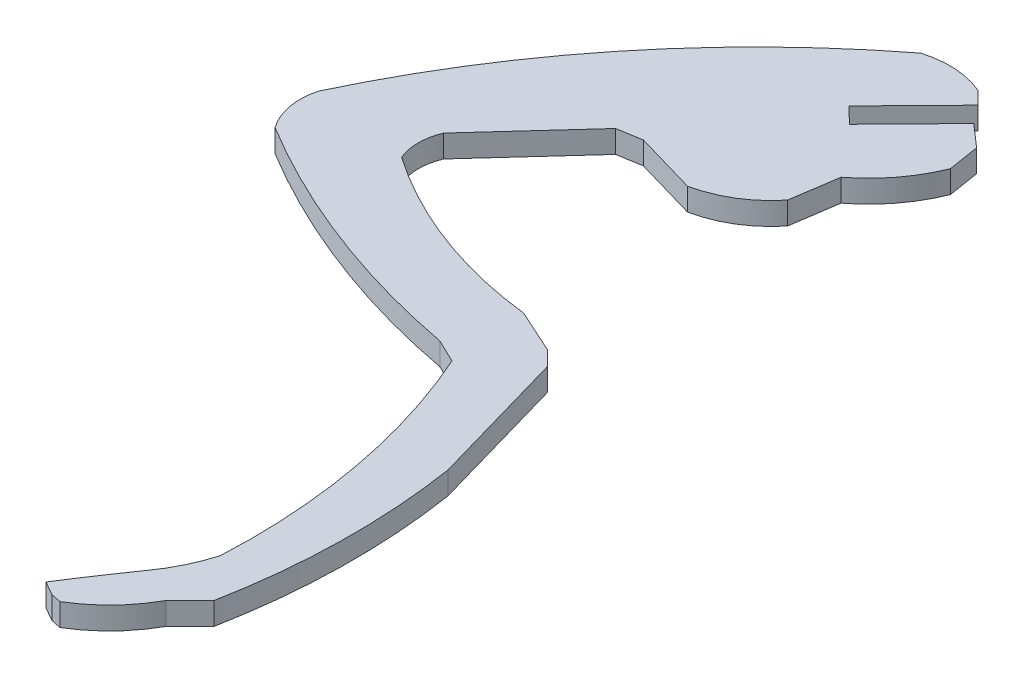
ISO-10303-21;
HEADER;
FILE_DESCRIPTION(('STEP AP214'),'2;1');
FILE_NAME('part.step','',(''),(''),'','','');
FILE_SCHEMA(('AUTOMOTIVE_DESIGN { 1 0 10303 214 1 1 1 1 }'));
ENDSEC;
DATA;
#1=APPLICATION_CONTEXT('core data for automotive mechanical design processes');
#2=APPLICATION_PROTOCOL_DEFINITION('international standard','automotive_design',2000,#1);
#3=PRODUCT_CONTEXT('',#1,'mechanical');
#4=PRODUCT('Part','Part','',(#3));
#5=PRODUCT_RELATED_PRODUCT_CATEGORY('part','',(#4));
#6=PRODUCT_DEFINITION_FORMATION('','',#4);
#7=PRODUCT_DEFINITION_CONTEXT('part definition',#1,'design');
#8=PRODUCT_DEFINITION('design','',#6,#7);
#9=PRODUCT_DEFINITION_SHAPE('','',#8);
#10=(LENGTH_UNIT() NAMED_UNIT(*) SI_UNIT(.MILLI.,.METRE.));
#11=(NAMED_UNIT(*) PLANE_ANGLE_UNIT() SI_UNIT($,.RADIAN.));
#12=(NAMED_UNIT(*) SI_UNIT($,.STERADIAN.) SOLID_ANGLE_UNIT());
#13=UNCERTAINTY_MEASURE_WITH_UNIT(LENGTH_MEASURE(1.E-05),#10,'distance_accuracy_value','');
#14=(GEOMETRIC_REPRESENTATION_CONTEXT(3) GLOBAL_UNCERTAINTY_ASSIGNED_CONTEXT((#13)) GLOBAL_UNIT_ASSIGNED_CONTEXT((#10,
#11,#12)) REPRESENTATION_CONTEXT('',''));
#15=CARTESIAN_POINT('',(0.,0.,0.));
#16=DIRECTION('',(0.,0.,1.));
#17=DIRECTION('',(1.,0.,0.));
#18=AXIS2_PLACEMENT_3D('',#15,#16,#17);
#19=CARTESIAN_POINT('',(3.2091,2.,-524.05296));
#20=DIRECTION('',(-0.164333825637548,0.,-0.986404781898044));
#21=DIRECTION('',(-0.986404781898044,0.,0.164333825637548));
#22=AXIS2_PLACEMENT_3D('',#19,#20,#21);
#23=PLANE('',#22);
#24=DIRECTION('',(0.986404781898044,0.,-0.164333825637548));
#25=VECTOR('',#24,1.);
#26=CARTESIAN_POINT('',(3.2091,0.,-524.05296));
#27=LINE('',#26,#25);
#28=CARTESIAN_POINT('',(3.2091,0.,-524.05296));
#29=VERTEX_POINT('',#28);
#30=CARTESIAN_POINT('',(5.34477,0.,-524.40876));
#31=VERTEX_POINT('',#30);
#32=EDGE_CURVE('E11',#29,#31,#27,.T.);
#33=ORIENTED_EDGE('',*,*,#32,.T.);
#34=DIRECTION('',(0.,-1.,0.));
#35=VECTOR('',#34,1.);
#36=CARTESIAN_POINT('',(5.34477,2.,-524.40876));
#37=LINE('',#36,#35);
#38=CARTESIAN_POINT('',(5.34477,2.,-524.40876));
#39=VERTEX_POINT('',#38);
#40=EDGE_CURVE('E577',#39,#31,#37,.T.);
#41=ORIENTED_EDGE('',*,*,#40,.F.);
#42=DIRECTION('',(0.986404781898044,0.,-0.164333825637548));
#43=VECTOR('',#42,1.);
#44=CARTESIAN_POINT('',(3.2091,2.,-524.05296));
#45=LINE('',#44,#43);
#46=CARTESIAN_POINT('',(3.2091,2.,-524.05296));
#47=VERTEX_POINT('',#46);
#48=EDGE_CURVE('E41',#47,#39,#45,.T.);
#49=ORIENTED_EDGE('',*,*,#48,.F.);
#50=DIRECTION('',(0.,-1.,0.));
#51=VECTOR('',#50,1.);
#52=CARTESIAN_POINT('',(3.2091,2.,-524.05296));
#53=LINE('',#52,#51);
#54=EDGE_CURVE('E272',#47,#29,#53,.T.);
#55=ORIENTED_EDGE('',*,*,#54,.T.);
#56=EDGE_LOOP('',(#33,#41,#49,#55));
#57=FACE_BOUND('',#56,.T.);
#58=ADVANCED_FACE('F37',(#57),#23,.F.);
#59=CARTESIAN_POINT('',(5.34477,2.,-524.40876));
#60=DIRECTION('',(0.278666159924539,0.,-0.960388031637687));
#61=DIRECTION('',(-0.960388031637687,0.,-0.278666159924539));
#62=AXIS2_PLACEMENT_3D('',#59,#60,#61);
#63=PLANE('',#62);
#64=DIRECTION('',(0.960388031637687,0.,0.278666159924539));
#65=VECTOR('',#64,1.);
#66=CARTESIAN_POINT('',(5.34477,0.,-524.40876));
#67=LINE('',#66,#65);
#68=CARTESIAN_POINT('',(10.86152,0.,-522.80802));
#69=VERTEX_POINT('',#68);
#70=EDGE_CURVE('E47',#31,#69,#67,.T.);
#71=ORIENTED_EDGE('',*,*,#70,.T.);
#72=DIRECTION('',(0.,-1.,0.));
#73=VECTOR('',#72,1.);
#74=CARTESIAN_POINT('',(10.86152,2.,-522.80802));
#75=LINE('',#74,#73);
#76=CARTESIAN_POINT('',(10.86152,2.,-522.80802));
#77=VERTEX_POINT('',#76);
#78=EDGE_CURVE('E248',#77,#69,#75,.T.);
#79=ORIENTED_EDGE('',*,*,#78,.F.);
#80=DIRECTION('',(0.960388031637687,0.,0.278666159924539));
#81=VECTOR('',#80,1.);
#82=CARTESIAN_POINT('',(5.34477,2.,-524.40876));
#83=LINE('',#82,#81);
#84=EDGE_CURVE('E149',#39,#77,#83,.T.);
#85=ORIENTED_EDGE('',*,*,#84,.F.);
#86=ORIENTED_EDGE('',*,*,#40,.T.);
#87=EDGE_LOOP('',(#71,#79,#85,#86));
#88=FACE_BOUND('',#87,.T.);
#89=ADVANCED_FACE('F578',(#88),#63,.F.);
#90=CARTESIAN_POINT('',(8.8943416746971,2.,-532.213271025797));
#91=DIRECTION('',(0.,-1.,0.));
#92=DIRECTION('',(0.,0.,-1.));
#93=AXIS2_PLACEMENT_3D('',#90,#91,#92);
#94=CYLINDRICAL_SURFACE('',#93,9.60877398120006);
#95=CARTESIAN_POINT('',(8.8943416746971,0.,-532.213271025797));
#96=DIRECTION('',(0.,1.,0.));
#97=DIRECTION('',(0.,0.,1.));
#98=AXIS2_PLACEMENT_3D('',#95,#96,#97);
#99=CIRCLE('',#98,9.60877398120006);
#100=CARTESIAN_POINT('',(16.3788200000389,0.,-526.187400000021));
#101=VERTEX_POINT('',#100);
#102=EDGE_CURVE('E242',#69,#101,#99,.T.);
#103=ORIENTED_EDGE('',*,*,#102,.T.);
#104=DIRECTION('',(0.,-1.,0.));
#105=VECTOR('',#104,1.);
#106=CARTESIAN_POINT('',(16.3788200000389,2.,-526.187400000021));
#107=LINE('',#106,#105);
#108=CARTESIAN_POINT('',(16.3788200000389,2.,-526.187400000021));
#109=VERTEX_POINT('',#108);
#110=EDGE_CURVE('E246',#109,#101,#107,.T.);
#111=ORIENTED_EDGE('',*,*,#110,.F.);
#112=CARTESIAN_POINT('',(8.8943416746971,2.,-532.213271025797));
#113=DIRECTION('',(0.,1.,0.));
#114=DIRECTION('',(0.,0.,1.));
#115=AXIS2_PLACEMENT_3D('',#112,#113,#114);
#116=CIRCLE('',#115,9.60877398120006);
#117=EDGE_CURVE('E327',#77,#109,#116,.T.);
#118=ORIENTED_EDGE('',*,*,#117,.F.);
#119=ORIENTED_EDGE('',*,*,#78,.T.);
#120=EDGE_LOOP('',(#103,#111,#118,#119));
#121=FACE_BOUND('',#120,.T.);
#122=ADVANCED_FACE('F244',(#121),#94,.T.);
#123=CARTESIAN_POINT('',(16.3788200000389,2.,-526.187400000021));
#124=DIRECTION('',(-0.988895795305984,0.,-0.148610585175304));
#125=DIRECTION('',(-0.148610585175304,0.,0.988895795305984));
#126=AXIS2_PLACEMENT_3D('',#123,#124,#125);
#127=PLANE('',#126);
#128=DIRECTION('',(0.148610585175304,0.,-0.988895795305984));
#129=VECTOR('',#128,1.);
#130=CARTESIAN_POINT('',(16.3788200000389,0.,-526.187400000021));
#131=LINE('',#130,#129);
#132=CARTESIAN_POINT('',(17.00212,0.,-530.33501));
#133=VERTEX_POINT('',#132);
#134=EDGE_CURVE('E250',#101,#133,#131,.T.);
#135=ORIENTED_EDGE('',*,*,#134,.T.);
#136=DIRECTION('',(0.,-1.,0.));
#137=VECTOR('',#136,1.);
#138=CARTESIAN_POINT('',(17.00212,2.,-530.33501));
#139=LINE('',#138,#137);
#140=CARTESIAN_POINT('',(17.00212,2.,-530.33501));
#141=VERTEX_POINT('',#140);
#142=EDGE_CURVE('E257',#141,#133,#139,.T.);
#143=ORIENTED_EDGE('',*,*,#142,.F.);
#144=DIRECTION('',(0.148610585175304,0.,-0.988895795305984));
#145=VECTOR('',#144,1.);
#146=CARTESIAN_POINT('',(16.3788200000389,2.,-526.187400000021));
#147=LINE('',#146,#145);
#148=EDGE_CURVE('E256',#109,#141,#147,.T.);
#149=ORIENTED_EDGE('',*,*,#148,.F.);
#150=ORIENTED_EDGE('',*,*,#110,.T.);
#151=EDGE_LOOP('',(#135,#143,#149,#150));
#152=FACE_BOUND('',#151,.T.);
#153=ADVANCED_FACE('F253',(#152),#127,.F.);
#154=CARTESIAN_POINT('',(9.06553161628309,2.,-540.742732120858));
#155=DIRECTION('',(0.,-1.,0.));
#156=DIRECTION('',(0.,0.,-1.));
#157=AXIS2_PLACEMENT_3D('',#154,#155,#156);
#158=CYLINDRICAL_SURFACE('',#157,13.0885489996999);
#159=CARTESIAN_POINT('',(9.06553161628309,0.,-540.742732120858));
#160=DIRECTION('',(0.,1.,0.));
#161=DIRECTION('',(0.,0.,1.));
#162=AXIS2_PLACEMENT_3D('',#159,#160,#161);
#163=CIRCLE('',#162,13.0885489996999);
#164=CARTESIAN_POINT('',(21.2052899999942,0.,-535.850250000026));
#165=VERTEX_POINT('',#164);
#166=EDGE_CURVE('E262',#133,#165,#163,.T.);
#167=ORIENTED_EDGE('',*,*,#166,.T.);
#168=DIRECTION('',(0.,-1.,0.));
#169=VECTOR('',#168,1.);
#170=CARTESIAN_POINT('',(21.2052899999942,2.,-535.850250000026));
#171=LINE('',#170,#169);
#172=CARTESIAN_POINT('',(21.2052899999942,2.,-535.850250000026));
#173=VERTEX_POINT('',#172);
#174=EDGE_CURVE('E394',#173,#165,#171,.T.);
#175=ORIENTED_EDGE('',*,*,#174,.F.);
#176=CARTESIAN_POINT('',(9.06553161628309,2.,-540.742732120858));
#177=DIRECTION('',(0.,1.,0.));
#178=DIRECTION('',(0.,0.,1.));
#179=AXIS2_PLACEMENT_3D('',#176,#177,#178);
#180=CIRCLE('',#179,13.0885489996999);
#181=EDGE_CURVE('E324',#141,#173,#180,.T.);
#182=ORIENTED_EDGE('',*,*,#181,.F.);
#183=ORIENTED_EDGE('',*,*,#142,.T.);
#184=EDGE_LOOP('',(#167,#175,#182,#183));
#185=FACE_BOUND('',#184,.T.);
#186=ADVANCED_FACE('F572',(#185),#158,.T.);
#187=CARTESIAN_POINT('',(21.2052899999943,2.,-535.850250000026));
#188=DIRECTION('',(-0.987554318458377,0.,0.157278314125664));
#189=DIRECTION('',(0.157278314125664,0.,0.987554318458377));
#190=AXIS2_PLACEMENT_3D('',#187,#188,#189);
#191=PLANE('',#190);
#192=DIRECTION('',(-0.157278314125664,0.,-0.987554318458377));
#193=VECTOR('',#192,1.);
#194=CARTESIAN_POINT('',(21.2052899999943,0.,-535.850250000026));
#195=LINE('',#194,#193);
#196=CARTESIAN_POINT('',(20.76264,0.,-538.62966));
#197=VERTEX_POINT('',#196);
#198=EDGE_CURVE('E264',#165,#197,#195,.T.);
#199=ORIENTED_EDGE('',*,*,#198,.T.);
#200=DIRECTION('',(0.,-1.,0.));
#201=VECTOR('',#200,1.);
#202=CARTESIAN_POINT('',(20.76264,2.,-538.62966));
#203=LINE('',#202,#201);
#204=CARTESIAN_POINT('',(20.76264,2.,-538.62966));
#205=VERTEX_POINT('',#204);
#206=EDGE_CURVE('E391',#205,#197,#203,.T.);
#207=ORIENTED_EDGE('',*,*,#206,.F.);
#208=DIRECTION('',(-0.157278314125664,0.,-0.987554318458377));
#209=VECTOR('',#208,1.);
#210=CARTESIAN_POINT('',(21.2052899999943,2.,-535.850250000026));
#211=LINE('',#210,#209);
#212=EDGE_CURVE('E322',#173,#205,#211,.T.);
#213=ORIENTED_EDGE('',*,*,#212,.F.);
#214=ORIENTED_EDGE('',*,*,#174,.T.);
#215=EDGE_LOOP('',(#199,#207,#213,#214));
#216=FACE_BOUND('',#215,.T.);
#217=ADVANCED_FACE('F389',(#216),#191,.F.);
#218=CARTESIAN_POINT('',(20.76264,2.,-538.62966));
#219=DIRECTION('',(-0.658108863037957,0.,0.75292278780157));
#220=DIRECTION('',(0.75292278780157,0.,0.658108863037957));
#221=AXIS2_PLACEMENT_3D('',#218,#219,#220);
#222=PLANE('',#221);
#223=DIRECTION('',(-0.75292278780157,0.,-0.658108863037957));
#224=VECTOR('',#223,1.);
#225=CARTESIAN_POINT('',(20.76264,0.,-538.62966));
#226=LINE('',#225,#224);
#227=CARTESIAN_POINT('',(18.76737,0.,-540.37367));
#228=VERTEX_POINT('',#227);
#229=EDGE_CURVE('E384',#197,#228,#226,.T.);
#230=ORIENTED_EDGE('',*,*,#229,.T.);
#231=DIRECTION('',(0.,-1.,0.));
#232=VECTOR('',#231,1.);
#233=CARTESIAN_POINT('',(18.76737,2.,-540.37367));
#234=LINE('',#233,#232);
#235=CARTESIAN_POINT('',(18.76737,2.,-540.37367));
#236=VERTEX_POINT('',#235);
#237=EDGE_CURVE('E400',#236,#228,#234,.T.);
#238=ORIENTED_EDGE('',*,*,#237,.F.);
#239=DIRECTION('',(-0.75292278780157,0.,-0.658108863037957));
#240=VECTOR('',#239,1.);
#241=CARTESIAN_POINT('',(20.76264,2.,-538.62966));
#242=LINE('',#241,#240);
#243=EDGE_CURVE('E320',#205,#236,#242,.T.);
#244=ORIENTED_EDGE('',*,*,#243,.F.);
#245=ORIENTED_EDGE('',*,*,#206,.T.);
#246=EDGE_LOOP('',(#230,#238,#244,#245));
#247=FACE_BOUND('',#246,.T.);
#248=ADVANCED_FACE('F397',(#247),#222,.F.);
#249=CARTESIAN_POINT('',(18.76737,2.,-540.37367));
#250=DIRECTION('',(0.714600178856164,0.,0.69953311885767));
#251=DIRECTION('',(0.69953311885767,0.,-0.714600178856164));
#252=AXIS2_PLACEMENT_3D('',#249,#250,#251);
#253=PLANE('',#252);
#254=DIRECTION('',(-0.69953311885767,0.,0.714600178856164));
#255=VECTOR('',#254,1.);
#256=CARTESIAN_POINT('',(18.76737,0.,-540.37367));
#257=LINE('',#256,#255);
#258=CARTESIAN_POINT('',(13.29769,0.,-534.78618));
#259=VERTEX_POINT('',#258);
#260=EDGE_CURVE('E382',#228,#259,#257,.T.);
#261=ORIENTED_EDGE('',*,*,#260,.T.);
#262=DIRECTION('',(0.,-1.,0.));
#263=VECTOR('',#262,1.);
#264=CARTESIAN_POINT('',(13.29769,2.,-534.78618));
#265=LINE('',#264,#263);
#266=CARTESIAN_POINT('',(13.29769,2.,-534.78618));
#267=VERTEX_POINT('',#266);
#268=EDGE_CURVE('E410',#267,#259,#265,.T.);
#269=ORIENTED_EDGE('',*,*,#268,.F.);
#270=DIRECTION('',(-0.69953311885767,0.,0.714600178856164));
#271=VECTOR('',#270,1.);
#272=CARTESIAN_POINT('',(18.76737,2.,-540.37367));
#273=LINE('',#272,#271);
#274=EDGE_CURVE('E318',#236,#267,#273,.T.);
#275=ORIENTED_EDGE('',*,*,#274,.F.);
#276=ORIENTED_EDGE('',*,*,#237,.T.);
#277=EDGE_LOOP('',(#261,#269,#275,#276));
#278=FACE_BOUND('',#277,.T.);
#279=ADVANCED_FACE('F408',(#278),#253,.F.);
#280=CARTESIAN_POINT('',(13.29769,2.,-534.78618));
#281=DIRECTION('',(-0.689955105026984,0.,0.7238521624249));
#282=DIRECTION('',(0.7238521624249,0.,0.689955105026984));
#283=AXIS2_PLACEMENT_3D('',#280,#281,#282);
#284=PLANE('',#283);
#285=DIRECTION('',(-0.7238521624249,0.,-0.689955105026984));
#286=VECTOR('',#285,1.);
#287=CARTESIAN_POINT('',(13.29769,0.,-534.78618));
#288=LINE('',#287,#286);
#289=CARTESIAN_POINT('',(11.84986,0.,-536.16621));
#290=VERTEX_POINT('',#289);
#291=EDGE_CURVE('E380',#259,#290,#288,.T.);
#292=ORIENTED_EDGE('',*,*,#291,.T.);
#293=DIRECTION('',(0.,-1.,0.));
#294=VECTOR('',#293,1.);
#295=CARTESIAN_POINT('',(11.84986,2.,-536.16621));
#296=LINE('',#295,#294);
#297=CARTESIAN_POINT('',(11.84986,2.,-536.16621));
#298=VERTEX_POINT('',#297);
#299=EDGE_CURVE('E416',#298,#290,#296,.T.);
#300=ORIENTED_EDGE('',*,*,#299,.F.);
#301=DIRECTION('',(-0.7238521624249,0.,-0.689955105026984));
#302=VECTOR('',#301,1.);
#303=CARTESIAN_POINT('',(13.29769,2.,-534.78618));
#304=LINE('',#303,#302);
#305=EDGE_CURVE('E316',#267,#298,#304,.T.);
#306=ORIENTED_EDGE('',*,*,#305,.F.);
#307=ORIENTED_EDGE('',*,*,#268,.T.);
#308=EDGE_LOOP('',(#292,#300,#306,#307));
#309=FACE_BOUND('',#308,.T.);
#310=ADVANCED_FACE('F413',(#309),#284,.F.);
#311=CARTESIAN_POINT('',(11.84986,2.,-536.16621));
#312=DIRECTION('',(-0.714600495511536,0.,-0.699532795381794));
#313=DIRECTION('',(-0.699532795381794,0.,0.714600495511536));
#314=AXIS2_PLACEMENT_3D('',#311,#312,#313);
#315=PLANE('',#314);
#316=DIRECTION('',(0.699532795381794,0.,-0.714600495511536));
#317=VECTOR('',#316,1.);
#318=CARTESIAN_POINT('',(11.84986,0.,-536.16621));
#319=LINE('',#318,#317);
#320=CARTESIAN_POINT('',(17.5389,0.,-541.97779));
#321=VERTEX_POINT('',#320);
#322=EDGE_CURVE('E378',#290,#321,#319,.T.);
#323=ORIENTED_EDGE('',*,*,#322,.T.);
#324=DIRECTION('',(0.,-1.,0.));
#325=VECTOR('',#324,1.);
#326=CARTESIAN_POINT('',(17.5389,2.,-541.97779));
#327=LINE('',#326,#325);
#328=CARTESIAN_POINT('',(17.5389,2.,-541.97779));
#329=VERTEX_POINT('',#328);
#330=EDGE_CURVE('E418',#329,#321,#327,.T.);
#331=ORIENTED_EDGE('',*,*,#330,.F.);
#332=DIRECTION('',(0.699532795381794,0.,-0.714600495511536));
#333=VECTOR('',#332,1.);
#334=CARTESIAN_POINT('',(11.84986,2.,-536.16621));
#335=LINE('',#334,#333);
#336=EDGE_CURVE('E314',#298,#329,#335,.T.);
#337=ORIENTED_EDGE('',*,*,#336,.F.);
#338=ORIENTED_EDGE('',*,*,#299,.T.);
#339=EDGE_LOOP('',(#323,#331,#337,#338));
#340=FACE_BOUND('',#339,.T.);
#341=ADVANCED_FACE('F568',(#340),#315,.F.);
#342=CARTESIAN_POINT('',(17.5389,2.,-541.97779));
#343=DIRECTION('',(-0.706854978608862,0.,0.707358494128589));
#344=DIRECTION('',(0.707358494128589,0.,0.706854978608862));
#345=AXIS2_PLACEMENT_3D('',#342,#343,#344);
#346=PLANE('',#345);
#347=DIRECTION('',(-0.707358494128589,0.,-0.706854978608862));
#348=VECTOR('',#347,1.);
#349=CARTESIAN_POINT('',(17.5389,0.,-541.97779));
#350=LINE('',#349,#348);
#351=CARTESIAN_POINT('',(16.40098,0.,-543.1149));
#352=VERTEX_POINT('',#351);
#353=EDGE_CURVE('E376',#321,#352,#350,.T.);
#354=ORIENTED_EDGE('',*,*,#353,.T.);
#355=DIRECTION('',(0.,-1.,0.));
#356=VECTOR('',#355,1.);
#357=CARTESIAN_POINT('',(16.40098,2.,-543.1149));
#358=LINE('',#357,#356);
#359=CARTESIAN_POINT('',(16.40098,2.,-543.1149));
#360=VERTEX_POINT('',#359);
#361=EDGE_CURVE('E424',#360,#352,#358,.T.);
#362=ORIENTED_EDGE('',*,*,#361,.F.);
#363=DIRECTION('',(-0.707358494128589,0.,-0.706854978608862));
#364=VECTOR('',#363,1.);
#365=CARTESIAN_POINT('',(17.5389,2.,-541.97779));
#366=LINE('',#365,#364);
#367=EDGE_CURVE('E312',#329,#360,#366,.T.);
#368=ORIENTED_EDGE('',*,*,#367,.F.);
#369=ORIENTED_EDGE('',*,*,#330,.T.);
#370=EDGE_LOOP('',(#354,#362,#368,#369));
#371=FACE_BOUND('',#370,.T.);
#372=ADVANCED_FACE('F565',(#371),#346,.F.);
#373=CARTESIAN_POINT('',(13.2541401091604,2.,-535.893799993688));
#374=DIRECTION('',(0.,-1.,0.));
#375=DIRECTION('',(0.,0.,-1.));
#376=AXIS2_PLACEMENT_3D('',#373,#374,#375);
#377=CYLINDRICAL_SURFACE('',#376,7.87698461340001);
#378=CARTESIAN_POINT('',(13.2541401091604,0.,-535.893799993688));
#379=DIRECTION('',(0.,1.,0.));
#380=DIRECTION('',(0.,0.,1.));
#381=AXIS2_PLACEMENT_3D('',#378,#379,#380);
#382=CIRCLE('',#381,7.87698461340001);
#383=CARTESIAN_POINT('',(10.9651199999629,0.,-543.430860000045));
#384=VERTEX_POINT('',#383);
#385=EDGE_CURVE('E374',#352,#384,#382,.T.);
#386=ORIENTED_EDGE('',*,*,#385,.T.);
#387=DIRECTION('',(0.,-1.,0.));
#388=VECTOR('',#387,1.);
#389=CARTESIAN_POINT('',(10.9651199999629,2.,-543.430860000045));
#390=LINE('',#389,#388);
#391=CARTESIAN_POINT('',(10.9651199999629,2.,-543.430860000045));
#392=VERTEX_POINT('',#391);
#393=EDGE_CURVE('E427',#392,#384,#390,.T.);
#394=ORIENTED_EDGE('',*,*,#393,.F.);
#395=CARTESIAN_POINT('',(13.2541401091604,2.,-535.893799993688));
#396=DIRECTION('',(0.,1.,0.));
#397=DIRECTION('',(0.,0.,1.));
#398=AXIS2_PLACEMENT_3D('',#395,#396,#397);
#399=CIRCLE('',#398,7.87698461340001);
#400=EDGE_CURVE('E310',#360,#392,#399,.T.);
#401=ORIENTED_EDGE('',*,*,#400,.F.);
#402=ORIENTED_EDGE('',*,*,#361,.T.);
#403=EDGE_LOOP('',(#386,#394,#401,#402));
#404=FACE_BOUND('',#403,.T.);
#405=ADVANCED_FACE('F561',(#404),#377,.T.);
#406=CARTESIAN_POINT('',(60.3970241388721,2.,-479.331782695554));
#407=DIRECTION('',(0.,-1.,0.));
#408=DIRECTION('',(0.,0.,-1.));
#409=AXIS2_PLACEMENT_3D('',#406,#407,#408);
#410=CYLINDRICAL_SURFACE('',#409,80.9456907938);
#411=CARTESIAN_POINT('',(60.3970241388721,0.,-479.331782695554));
#412=DIRECTION('',(0.,1.,0.));
#413=DIRECTION('',(0.,0.,1.));
#414=AXIS2_PLACEMENT_3D('',#411,#412,#413);
#415=CIRCLE('',#414,80.9456907938);
#416=CARTESIAN_POINT('',(-12.8890900000082,0.,-513.702559999951));
#417=VERTEX_POINT('',#416);
#418=EDGE_CURVE('E372',#384,#417,#415,.T.);
#419=ORIENTED_EDGE('',*,*,#418,.T.);
#420=DIRECTION('',(0.,-1.,0.));
#421=VECTOR('',#420,1.);
#422=CARTESIAN_POINT('',(-12.8890900000082,2.,-513.702559999951));
#423=LINE('',#422,#421);
#424=CARTESIAN_POINT('',(-12.8890900000082,2.,-513.702559999951));
#425=VERTEX_POINT('',#424);
#426=EDGE_CURVE('E430',#425,#417,#423,.T.);
#427=ORIENTED_EDGE('',*,*,#426,.F.);
#428=CARTESIAN_POINT('',(60.3970241388721,2.,-479.331782695554));
#429=DIRECTION('',(0.,1.,0.));
#430=DIRECTION('',(0.,0.,1.));
#431=AXIS2_PLACEMENT_3D('',#428,#429,#430);
#432=CIRCLE('',#431,80.9456907938);
#433=EDGE_CURVE('E308',#392,#425,#432,.T.);
#434=ORIENTED_EDGE('',*,*,#433,.F.);
#435=ORIENTED_EDGE('',*,*,#393,.T.);
#436=EDGE_LOOP('',(#419,#427,#434,#435));
#437=FACE_BOUND('',#436,.T.);
#438=ADVANCED_FACE('F556',(#437),#410,.T.);
#439=CARTESIAN_POINT('',(-7.41712116406104,2.,-512.273286230046));
#440=DIRECTION('',(0.,-1.,0.));
#441=DIRECTION('',(0.,0.,-1.));
#442=AXIS2_PLACEMENT_3D('',#439,#440,#441);
#443=CYLINDRICAL_SURFACE('',#442,5.65555182549999);
#444=CARTESIAN_POINT('',(-7.41712116406104,0.,-512.273286230046));
#445=DIRECTION('',(0.,1.,0.));
#446=DIRECTION('',(0.,0.,1.));
#447=AXIS2_PLACEMENT_3D('',#444,#445,#446);
#448=CIRCLE('',#447,5.65555182549999);
#449=CARTESIAN_POINT('',(-12.0037900000369,0.,-508.964550000002));
#450=VERTEX_POINT('',#449);
#451=EDGE_CURVE('E370',#417,#450,#448,.T.);
#452=ORIENTED_EDGE('',*,*,#451,.T.);
#453=DIRECTION('',(0.,-1.,0.));
#454=VECTOR('',#453,1.);
#455=CARTESIAN_POINT('',(-12.0037900000369,2.,-508.964550000002));
#456=LINE('',#455,#454);
#457=CARTESIAN_POINT('',(-12.0037900000369,2.,-508.964550000002));
#458=VERTEX_POINT('',#457);
#459=EDGE_CURVE('E433',#458,#450,#456,.T.);
#460=ORIENTED_EDGE('',*,*,#459,.F.);
#461=CARTESIAN_POINT('',(-7.41712116406104,2.,-512.273286230046));
#462=DIRECTION('',(0.,1.,0.));
#463=DIRECTION('',(0.,0.,1.));
#464=AXIS2_PLACEMENT_3D('',#461,#462,#463);
#465=CIRCLE('',#464,5.65555182549999);
#466=EDGE_CURVE('E306',#425,#458,#465,.T.);
#467=ORIENTED_EDGE('',*,*,#466,.F.);
#468=ORIENTED_EDGE('',*,*,#426,.T.);
#469=EDGE_LOOP('',(#452,#460,#467,#468));
#470=FACE_BOUND('',#469,.T.);
#471=ADVANCED_FACE('F550',(#470),#443,.T.);
#472=CARTESIAN_POINT('',(24.9059589561641,2.,-569.804934226707));
#473=DIRECTION('',(0.,-1.,0.));
#474=DIRECTION('',(0.,0.,-1.));
#475=AXIS2_PLACEMENT_3D('',#472,#473,#474);
#476=CYLINDRICAL_SURFACE('',#475,71.1609578410999);
#477=CARTESIAN_POINT('',(24.9059589561641,0.,-569.804934226707));
#478=DIRECTION('',(0.,1.,0.));
#479=DIRECTION('',(0.,0.,1.));
#480=AXIS2_PLACEMENT_3D('',#477,#478,#479);
#481=CIRCLE('',#480,71.1609578410999);
#482=CARTESIAN_POINT('',(11.7639899999997,0.,-499.868029999982));
#483=VERTEX_POINT('',#482);
#484=EDGE_CURVE('E368',#450,#483,#481,.T.);
#485=ORIENTED_EDGE('',*,*,#484,.T.);
#486=DIRECTION('',(0.,-1.,0.));
#487=VECTOR('',#486,1.);
#488=CARTESIAN_POINT('',(11.7639899999997,2.,-499.868029999982));
#489=LINE('',#488,#487);
#490=CARTESIAN_POINT('',(11.7639899999997,2.,-499.868029999982));
#491=VERTEX_POINT('',#490);
#492=EDGE_CURVE('E436',#491,#483,#489,.T.);
#493=ORIENTED_EDGE('',*,*,#492,.F.);
#494=CARTESIAN_POINT('',(24.9059589561641,2.,-569.804934226707));
#495=DIRECTION('',(0.,1.,0.));
#496=DIRECTION('',(0.,0.,1.));
#497=AXIS2_PLACEMENT_3D('',#494,#495,#496);
#498=CIRCLE('',#497,71.1609578410999);
#499=EDGE_CURVE('E304',#458,#491,#498,.T.);
#500=ORIENTED_EDGE('',*,*,#499,.F.);
#501=ORIENTED_EDGE('',*,*,#459,.T.);
#502=EDGE_LOOP('',(#485,#493,#500,#501));
#503=FACE_BOUND('',#502,.T.);
#504=ADVANCED_FACE('F546',(#503),#476,.T.);
#505=CARTESIAN_POINT('',(11.7639899999997,2.,-499.868029999982));
#506=DIRECTION('',(0.436072051949403,0.,-0.899911754289629));
#507=DIRECTION('',(-0.899911754289629,0.,-0.436072051949403));
#508=AXIS2_PLACEMENT_3D('',#505,#506,#507);
#509=PLANE('',#508);
#510=DIRECTION('',(0.899911754289629,0.,0.436072051949403));
#511=VECTOR('',#510,1.);
#512=CARTESIAN_POINT('',(11.7639899999997,0.,-499.868029999982));
#513=LINE('',#512,#511);
#514=CARTESIAN_POINT('',(13.84981,0.,-498.8573));
#515=VERTEX_POINT('',#514);
#516=EDGE_CURVE('E365',#483,#515,#513,.T.);
#517=ORIENTED_EDGE('',*,*,#516,.T.);
#518=DIRECTION('',(0.,-1.,0.));
#519=VECTOR('',#518,1.);
#520=CARTESIAN_POINT('',(13.84981,2.,-498.8573));
#521=LINE('',#520,#519);
#522=CARTESIAN_POINT('',(13.84981,2.,-498.8573));
#523=VERTEX_POINT('',#522);
#524=EDGE_CURVE('E439',#523,#515,#521,.T.);
#525=ORIENTED_EDGE('',*,*,#524,.F.);
#526=DIRECTION('',(0.899911754289629,0.,0.436072051949403));
#527=VECTOR('',#526,1.);
#528=CARTESIAN_POINT('',(11.7639899999997,2.,-499.868029999982));
#529=LINE('',#528,#527);
#530=EDGE_CURVE('E302',#491,#523,#529,.T.);
#531=ORIENTED_EDGE('',*,*,#530,.F.);
#532=ORIENTED_EDGE('',*,*,#492,.T.);
#533=EDGE_LOOP('',(#517,#525,#531,#532));
#534=FACE_BOUND('',#533,.T.);
#535=ADVANCED_FACE('F541',(#534),#509,.F.);
#536=CARTESIAN_POINT('',(-37.0431303259165,2.,-476.325891757937));
#537=DIRECTION('',(0.,-1.,0.));
#538=DIRECTION('',(0.,0.,-1.));
#539=AXIS2_PLACEMENT_3D('',#536,#537,#538);
#540=CYLINDRICAL_SURFACE('',#539,55.6574858611915);
#541=CARTESIAN_POINT('',(-37.0431303259165,0.,-476.325891757937));
#542=DIRECTION('',(0.,1.,0.));
#543=DIRECTION('',(0.,0.,1.));
#544=AXIS2_PLACEMENT_3D('',#541,#542,#543);
#545=CIRCLE('',#544,55.6574858611915);
#546=CARTESIAN_POINT('',(18.5444199999836,0.,-473.536630000005));
#547=VERTEX_POINT('',#546);
#548=EDGE_CURVE('E362',#547,#515,#545,.T.);
#549=ORIENTED_EDGE('',*,*,#548,.F.);
#550=DIRECTION('',(0.,-1.,0.));
#551=VECTOR('',#550,1.);
#552=CARTESIAN_POINT('',(18.5444199999836,2.,-473.536630000005));
#553=LINE('',#552,#551);
#554=CARTESIAN_POINT('',(18.5444199999836,2.,-473.536630000005));
#555=VERTEX_POINT('',#554);
#556=EDGE_CURVE('E441',#555,#547,#553,.T.);
#557=ORIENTED_EDGE('',*,*,#556,.F.);
#558=CARTESIAN_POINT('',(-37.0431303259165,2.,-476.325891757937));
#559=DIRECTION('',(0.,1.,0.));
#560=DIRECTION('',(0.,0.,1.));
#561=AXIS2_PLACEMENT_3D('',#558,#559,#560);
#562=CIRCLE('',#561,55.6574858611915);
#563=EDGE_CURVE('E299',#555,#523,#562,.T.);
#564=ORIENTED_EDGE('',*,*,#563,.T.);
#565=ORIENTED_EDGE('',*,*,#524,.T.);
#566=EDGE_LOOP('',(#549,#557,#564,#565));
#567=FACE_BOUND('',#566,.T.);
#568=ADVANCED_FACE('F535',(#567),#540,.F.);
#569=CARTESIAN_POINT('',(4.6293018942,2.,-477.5657544752));
#570=DIRECTION('',(0.,-1.,0.));
#571=DIRECTION('',(0.,0.,-1.));
#572=AXIS2_PLACEMENT_3D('',#569,#570,#571);
#573=CYLINDRICAL_SURFACE('',#572,14.4866958252999);
#574=CARTESIAN_POINT('',(4.6293018942,0.,-477.5657544752));
#575=DIRECTION('',(0.,1.,0.));
#576=DIRECTION('',(0.,0.,1.));
#577=AXIS2_PLACEMENT_3D('',#574,#575,#576);
#578=CIRCLE('',#577,14.4866958252999);
#579=CARTESIAN_POINT('',(16.3954399999978,0.,-469.114580000013));
#580=VERTEX_POINT('',#579);
#581=EDGE_CURVE('E359',#580,#547,#578,.T.);
#582=ORIENTED_EDGE('',*,*,#581,.F.);
#583=DIRECTION('',(0.,-1.,0.));
#584=VECTOR('',#583,1.);
#585=CARTESIAN_POINT('',(16.3954399999978,2.,-469.114580000013));
#586=LINE('',#585,#584);
#587=CARTESIAN_POINT('',(16.3954399999978,2.,-469.114580000013));
#588=VERTEX_POINT('',#587);
#589=EDGE_CURVE('E443',#588,#580,#586,.T.);
#590=ORIENTED_EDGE('',*,*,#589,.F.);
#591=CARTESIAN_POINT('',(4.6293018942,2.,-477.5657544752));
#592=DIRECTION('',(0.,1.,0.));
#593=DIRECTION('',(0.,0.,1.));
#594=AXIS2_PLACEMENT_3D('',#591,#592,#593);
#595=CIRCLE('',#594,14.4866958252999);
#596=EDGE_CURVE('E296',#588,#555,#595,.T.);
#597=ORIENTED_EDGE('',*,*,#596,.T.);
#598=ORIENTED_EDGE('',*,*,#556,.T.);
#599=EDGE_LOOP('',(#582,#590,#597,#598));
#600=FACE_BOUND('',#599,.T.);
#601=ADVANCED_FACE('F531',(#600),#573,.F.);
#602=CARTESIAN_POINT('',(131.011021561522,2.,-388.704744944553));
#603=DIRECTION('',(0.,-1.,0.));
#604=DIRECTION('',(0.,0.,-1.));
#605=AXIS2_PLACEMENT_3D('',#602,#603,#604);
#606=CYLINDRICAL_SURFACE('',#605,140.0088322583);
#607=CARTESIAN_POINT('',(131.011021561522,0.,-388.704744944553));
#608=DIRECTION('',(0.,1.,0.));
#609=DIRECTION('',(0.,0.,1.));
#610=AXIS2_PLACEMENT_3D('',#607,#608,#609);
#611=CIRCLE('',#610,140.0088322583);
#612=CARTESIAN_POINT('',(12.8193600000259,0.,-463.759419999911));
#613=VERTEX_POINT('',#612);
#614=EDGE_CURVE('E357',#580,#613,#611,.T.);
#615=ORIENTED_EDGE('',*,*,#614,.T.);
#616=DIRECTION('',(0.,-1.,0.));
#617=VECTOR('',#616,1.);
#618=CARTESIAN_POINT('',(12.8193600000259,2.,-463.759419999911));
#619=LINE('',#618,#617);
#620=CARTESIAN_POINT('',(12.8193600000259,2.,-463.759419999911));
#621=VERTEX_POINT('',#620);
#622=EDGE_CURVE('E445',#621,#613,#619,.T.);
#623=ORIENTED_EDGE('',*,*,#622,.F.);
#624=CARTESIAN_POINT('',(131.011021561522,2.,-388.704744944553));
#625=DIRECTION('',(0.,1.,0.));
#626=DIRECTION('',(0.,0.,1.));
#627=AXIS2_PLACEMENT_3D('',#624,#625,#626);
#628=CIRCLE('',#627,140.0088322583);
#629=EDGE_CURVE('E294',#588,#621,#628,.T.);
#630=ORIENTED_EDGE('',*,*,#629,.F.);
#631=ORIENTED_EDGE('',*,*,#589,.T.);
#632=EDGE_LOOP('',(#615,#623,#630,#631));
#633=FACE_BOUND('',#632,.T.);
#634=ADVANCED_FACE('F527',(#633),#606,.T.);
#635=CARTESIAN_POINT('',(12.8193600000259,2.,-463.759419999911));
#636=DIRECTION('',(0.495943782083639,0.,-0.868354630904088));
#637=DIRECTION('',(-0.868354630904089,0.,-0.495943782083639));
#638=AXIS2_PLACEMENT_3D('',#635,#636,#637);
#639=PLANE('',#638);
#640=DIRECTION('',(0.868354630904088,0.,0.495943782083639));
#641=VECTOR('',#640,1.);
#642=CARTESIAN_POINT('',(12.8193600000259,0.,-463.759419999911));
#643=LINE('',#642,#641);
#644=CARTESIAN_POINT('',(14.06531,0.,-463.04782));
#645=VERTEX_POINT('',#644);
#646=EDGE_CURVE('E355',#613,#645,#643,.T.);
#647=ORIENTED_EDGE('',*,*,#646,.T.);
#648=DIRECTION('',(0.,-1.,0.));
#649=VECTOR('',#648,1.);
#650=CARTESIAN_POINT('',(14.06531,2.,-463.04782));
#651=LINE('',#650,#649);
#652=CARTESIAN_POINT('',(14.06531,2.,-463.04782));
#653=VERTEX_POINT('',#652);
#654=EDGE_CURVE('E448',#653,#645,#651,.T.);
#655=ORIENTED_EDGE('',*,*,#654,.F.);
#656=DIRECTION('',(0.868354630904088,0.,0.495943782083639));
#657=VECTOR('',#656,1.);
#658=CARTESIAN_POINT('',(12.8193600000259,2.,-463.759419999911));
#659=LINE('',#658,#657);
#660=EDGE_CURVE('E292',#621,#653,#659,.T.);
#661=ORIENTED_EDGE('',*,*,#660,.F.);
#662=ORIENTED_EDGE('',*,*,#622,.T.);
#663=EDGE_LOOP('',(#647,#655,#661,#662));
#664=FACE_BOUND('',#663,.T.);
#665=ADVANCED_FACE('F523',(#664),#639,.F.);
#666=CARTESIAN_POINT('',(14.06531,2.,-463.04782));
#667=DIRECTION('',(0.195696431567666,0.,-0.980664523000441));
#668=DIRECTION('',(-0.980664523000441,0.,-0.195696431567666));
#669=AXIS2_PLACEMENT_3D('',#666,#667,#668);
#670=PLANE('',#669);
#671=DIRECTION('',(0.980664523000441,0.,0.195696431567666));
#672=VECTOR('',#671,1.);
#673=CARTESIAN_POINT('',(14.06531,0.,-463.04782));
#674=LINE('',#673,#672);
#675=CARTESIAN_POINT('',(14.95504,0.,-462.87027));
#676=VERTEX_POINT('',#675);
#677=EDGE_CURVE('E353',#645,#676,#674,.T.);
#678=ORIENTED_EDGE('',*,*,#677,.T.);
#679=DIRECTION('',(0.,-1.,0.));
#680=VECTOR('',#679,1.);
#681=CARTESIAN_POINT('',(14.95504,2.,-462.87027));
#682=LINE('',#681,#680);
#683=CARTESIAN_POINT('',(14.95504,2.,-462.87027));
#684=VERTEX_POINT('',#683);
#685=EDGE_CURVE('E451',#684,#676,#682,.T.);
#686=ORIENTED_EDGE('',*,*,#685,.F.);
#687=DIRECTION('',(0.980664523000441,0.,0.195696431567666));
#688=VECTOR('',#687,1.);
#689=CARTESIAN_POINT('',(14.06531,2.,-463.04782));
#690=LINE('',#689,#688);
#691=EDGE_CURVE('E290',#653,#684,#690,.T.);
#692=ORIENTED_EDGE('',*,*,#691,.F.);
#693=ORIENTED_EDGE('',*,*,#654,.T.);
#694=EDGE_LOOP('',(#678,#686,#692,#693));
#695=FACE_BOUND('',#694,.T.);
#696=ADVANCED_FACE('F518',(#695),#670,.F.);
#697=CARTESIAN_POINT('',(8.33154438728053,2.,-473.884074552546));
#698=DIRECTION('',(0.,-1.,0.));
#699=DIRECTION('',(0.,0.,-1.));
#700=AXIS2_PLACEMENT_3D('',#697,#698,#699);
#701=CYLINDRICAL_SURFACE('',#700,12.8520264882);
#702=CARTESIAN_POINT('',(8.33154438728053,0.,-473.884074552546));
#703=DIRECTION('',(0.,1.,0.));
#704=DIRECTION('',(0.,0.,1.));
#705=AXIS2_PLACEMENT_3D('',#702,#703,#704);
#706=CIRCLE('',#705,12.8520264882);
#707=CARTESIAN_POINT('',(19.5826200000662,0.,-467.672159999948));
#708=VERTEX_POINT('',#707);
#709=EDGE_CURVE('E351',#676,#708,#706,.T.);
#710=ORIENTED_EDGE('',*,*,#709,.T.);
#711=DIRECTION('',(0.,-1.,0.));
#712=VECTOR('',#711,1.);
#713=CARTESIAN_POINT('',(19.5826200000662,2.,-467.672159999948));
#714=LINE('',#713,#712);
#715=CARTESIAN_POINT('',(19.5826200000662,2.,-467.672159999948));
#716=VERTEX_POINT('',#715);
#717=EDGE_CURVE('E454',#716,#708,#714,.T.);
#718=ORIENTED_EDGE('',*,*,#717,.F.);
#719=CARTESIAN_POINT('',(8.33154438728053,2.,-473.884074552546));
#720=DIRECTION('',(0.,1.,0.));
#721=DIRECTION('',(0.,0.,1.));
#722=AXIS2_PLACEMENT_3D('',#719,#720,#721);
#723=CIRCLE('',#722,12.8520264882);
#724=EDGE_CURVE('E288',#684,#716,#723,.T.);
#725=ORIENTED_EDGE('',*,*,#724,.F.);
#726=ORIENTED_EDGE('',*,*,#685,.T.);
#727=EDGE_LOOP('',(#710,#718,#725,#726));
#728=FACE_BOUND('',#727,.T.);
#729=ADVANCED_FACE('F512',(#728),#701,.T.);
#730=CARTESIAN_POINT('',(19.5826200000662,2.,-467.672159999948));
#731=DIRECTION('',(-0.706903070629825,0.,-0.707310433073148));
#732=DIRECTION('',(-0.707310433073148,0.,0.706903070629825));
#733=AXIS2_PLACEMENT_3D('',#730,#731,#732);
#734=PLANE('',#733);
#735=DIRECTION('',(0.707310433073148,0.,-0.706903070629825));
#736=VECTOR('',#735,1.);
#737=CARTESIAN_POINT('',(19.5826200000662,0.,-467.672159999948));
#738=LINE('',#737,#736);
#739=CARTESIAN_POINT('',(21.71829,0.,-469.8066));
#740=VERTEX_POINT('',#739);
#741=EDGE_CURVE('E349',#708,#740,#738,.T.);
#742=ORIENTED_EDGE('',*,*,#741,.T.);
#743=DIRECTION('',(0.,-1.,0.));
#744=VECTOR('',#743,1.);
#745=CARTESIAN_POINT('',(21.71829,2.,-469.8066));
#746=LINE('',#745,#744);
#747=CARTESIAN_POINT('',(21.71829,2.,-469.8066));
#748=VERTEX_POINT('',#747);
#749=EDGE_CURVE('E457',#748,#740,#746,.T.);
#750=ORIENTED_EDGE('',*,*,#749,.F.);
#751=DIRECTION('',(0.707310433073148,0.,-0.706903070629825));
#752=VECTOR('',#751,1.);
#753=CARTESIAN_POINT('',(19.5826200000662,2.,-467.672159999948));
#754=LINE('',#753,#752);
#755=EDGE_CURVE('E286',#716,#748,#754,.T.);
#756=ORIENTED_EDGE('',*,*,#755,.F.);
#757=ORIENTED_EDGE('',*,*,#717,.T.);
#758=EDGE_LOOP('',(#742,#750,#756,#757));
#759=FACE_BOUND('',#758,.T.);
#760=ADVANCED_FACE('F508',(#759),#734,.F.);
#761=CARTESIAN_POINT('',(-36.9044098651865,2.,-481.055857754714));
#762=DIRECTION('',(0.,-1.,0.));
#763=DIRECTION('',(0.,0.,-1.));
#764=AXIS2_PLACEMENT_3D('',#761,#762,#763);
#765=CYLINDRICAL_SURFACE('',#764,59.6922669993);
#766=CARTESIAN_POINT('',(-36.9044098651865,0.,-481.055857754714));
#767=DIRECTION('',(0.,1.,0.));
#768=DIRECTION('',(0.,0.,1.));
#769=AXIS2_PLACEMENT_3D('',#766,#767,#768);
#770=CIRCLE('',#769,59.6922669993);
#771=CARTESIAN_POINT('',(22.0739599999575,0.,-490.260130000035));
#772=VERTEX_POINT('',#771);
#773=EDGE_CURVE('E347',#740,#772,#770,.T.);
#774=ORIENTED_EDGE('',*,*,#773,.T.);
#775=DIRECTION('',(0.,-1.,0.));
#776=VECTOR('',#775,1.);
#777=CARTESIAN_POINT('',(22.0739599999575,2.,-490.260130000035));
#778=LINE('',#777,#776);
#779=CARTESIAN_POINT('',(22.0739599999575,2.,-490.260130000035));
#780=VERTEX_POINT('',#779);
#781=EDGE_CURVE('E460',#780,#772,#778,.T.);
#782=ORIENTED_EDGE('',*,*,#781,.F.);
#783=CARTESIAN_POINT('',(-36.9044098651865,2.,-481.055857754714));
#784=DIRECTION('',(0.,1.,0.));
#785=DIRECTION('',(0.,0.,1.));
#786=AXIS2_PLACEMENT_3D('',#783,#784,#785);
#787=CIRCLE('',#786,59.6922669993);
#788=EDGE_CURVE('E284',#748,#780,#787,.T.);
#789=ORIENTED_EDGE('',*,*,#788,.F.);
#790=ORIENTED_EDGE('',*,*,#749,.T.);
#791=EDGE_LOOP('',(#774,#782,#789,#790));
#792=FACE_BOUND('',#791,.T.);
#793=ADVANCED_FACE('F503',(#792),#765,.T.);
#794=CARTESIAN_POINT('',(-75736.9870476276,2.,21162.2909873004));
#795=DIRECTION('',(0.,-1.,0.));
#796=DIRECTION('',(0.,0.,-1.));
#797=AXIS2_PLACEMENT_3D('',#794,#795,#796);
#798=CYLINDRICAL_SURFACE('',#797,78792.5649705906);
#799=CARTESIAN_POINT('',(-75736.9870476276,0.,21162.2909873004));
#800=DIRECTION('',(0.,1.,0.));
#801=DIRECTION('',(0.,0.,1.));
#802=AXIS2_PLACEMENT_3D('',#799,#800,#801);
#803=CIRCLE('',#802,78792.5649705906);
#804=CARTESIAN_POINT('',(18.5144999988296,0.,-502.710280004219));
#805=VERTEX_POINT('',#804);
#806=EDGE_CURVE('E345',#772,#805,#803,.T.);
#807=ORIENTED_EDGE('',*,*,#806,.T.);
#808=DIRECTION('',(0.,-1.,0.));
#809=VECTOR('',#808,1.);
#810=CARTESIAN_POINT('',(18.5144999988296,2.,-502.710280004219));
#811=LINE('',#810,#809);
#812=CARTESIAN_POINT('',(18.5144999988296,2.,-502.710280004219));
#813=VERTEX_POINT('',#812);
#814=EDGE_CURVE('E463',#813,#805,#811,.T.);
#815=ORIENTED_EDGE('',*,*,#814,.F.);
#816=CARTESIAN_POINT('',(-75736.9870476276,2.,21162.2909873004));
#817=DIRECTION('',(0.,1.,0.));
#818=DIRECTION('',(0.,0.,1.));
#819=AXIS2_PLACEMENT_3D('',#816,#817,#818);
#820=CIRCLE('',#819,78792.5649705906);
#821=EDGE_CURVE('E282',#780,#813,#820,.T.);
#822=ORIENTED_EDGE('',*,*,#821,.F.);
#823=ORIENTED_EDGE('',*,*,#781,.T.);
#824=EDGE_LOOP('',(#807,#815,#822,#823));
#825=FACE_BOUND('',#824,.T.);
#826=ADVANCED_FACE('F497',(#825),#798,.T.);
#827=CARTESIAN_POINT('',(18.5144999988261,2.,-502.710280004212));
#828=DIRECTION('',(-0.70697899635929,0.,0.707234542925338));
#829=DIRECTION('',(0.707234542925338,0.,0.70697899635929));
#830=AXIS2_PLACEMENT_3D('',#827,#828,#829);
#831=PLANE('',#830);
#832=DIRECTION('',(-0.707234542925338,0.,-0.70697899635929));
#833=VECTOR('',#832,1.);
#834=CARTESIAN_POINT('',(18.5144999988261,0.,-502.710280004212));
#835=LINE('',#834,#833);
#836=CARTESIAN_POINT('',(17.2691,0.,-503.95523));
#837=VERTEX_POINT('',#836);
#838=EDGE_CURVE('E343',#805,#837,#835,.T.);
#839=ORIENTED_EDGE('',*,*,#838,.T.);
#840=DIRECTION('',(0.,-1.,0.));
#841=VECTOR('',#840,1.);
#842=CARTESIAN_POINT('',(17.2691,2.,-503.95523));
#843=LINE('',#842,#841);
#844=CARTESIAN_POINT('',(17.2691,2.,-503.95523));
#845=VERTEX_POINT('',#844);
#846=EDGE_CURVE('E466',#845,#837,#843,.T.);
#847=ORIENTED_EDGE('',*,*,#846,.F.);
#848=DIRECTION('',(-0.707234542925338,0.,-0.70697899635929));
#849=VECTOR('',#848,1.);
#850=CARTESIAN_POINT('',(18.5144999988261,2.,-502.710280004212));
#851=LINE('',#850,#849);
#852=EDGE_CURVE('E280',#813,#845,#851,.T.);
#853=ORIENTED_EDGE('',*,*,#852,.F.);
#854=ORIENTED_EDGE('',*,*,#814,.T.);
#855=EDGE_LOOP('',(#839,#847,#853,#854));
#856=FACE_BOUND('',#855,.T.);
#857=ADVANCED_FACE('F493',(#856),#831,.F.);
#858=CARTESIAN_POINT('',(17.2691,2.,-503.95523));
#859=DIRECTION('',(-0.413568882022286,0.,0.910472833105325));
#860=DIRECTION('',(0.910472833105325,0.,0.413568882022286));
#861=AXIS2_PLACEMENT_3D('',#858,#859,#860);
#862=PLANE('',#861);
#863=DIRECTION('',(-0.910472833105325,0.,-0.413568882022286));
#864=VECTOR('',#863,1.);
#865=CARTESIAN_POINT('',(17.2691,0.,-503.95523));
#866=LINE('',#865,#864);
#867=CARTESIAN_POINT('',(13.353420000039,0.,-505.733870000073));
#868=VERTEX_POINT('',#867);
#869=EDGE_CURVE('E340',#837,#868,#866,.T.);
#870=ORIENTED_EDGE('',*,*,#869,.T.);
#871=DIRECTION('',(0.,-1.,0.));
#872=VECTOR('',#871,1.);
#873=CARTESIAN_POINT('',(13.353420000039,2.,-505.733870000073));
#874=LINE('',#873,#872);
#875=CARTESIAN_POINT('',(13.353420000039,2.,-505.733870000073));
#876=VERTEX_POINT('',#875);
#877=EDGE_CURVE('E469',#876,#868,#874,.T.);
#878=ORIENTED_EDGE('',*,*,#877,.F.);
#879=DIRECTION('',(-0.910472833105325,0.,-0.413568882022286));
#880=VECTOR('',#879,1.);
#881=CARTESIAN_POINT('',(17.2691,2.,-503.95523));
#882=LINE('',#881,#880);
#883=EDGE_CURVE('E278',#845,#876,#882,.T.);
#884=ORIENTED_EDGE('',*,*,#883,.F.);
#885=ORIENTED_EDGE('',*,*,#846,.T.);
#886=EDGE_LOOP('',(#870,#878,#884,#885));
#887=FACE_BOUND('',#886,.T.);
#888=ADVANCED_FACE('F488',(#887),#862,.F.);
#889=CARTESIAN_POINT('',(17.6873382140799,2.,-543.625576900925));
#890=DIRECTION('',(0.,-1.,0.));
#891=DIRECTION('',(0.,0.,-1.));
#892=AXIS2_PLACEMENT_3D('',#889,#890,#891);
#893=CYLINDRICAL_SURFACE('',#892,38.1387506212);
#894=CARTESIAN_POINT('',(17.6873382140799,0.,-543.625576900925));
#895=DIRECTION('',(0.,1.,0.));
#896=DIRECTION('',(0.,0.,1.));
#897=AXIS2_PLACEMENT_3D('',#894,#895,#896);
#898=CIRCLE('',#897,38.1387506212);
#899=CARTESIAN_POINT('',(-4.08821000001976,0.,-512.314399999992));
#900=VERTEX_POINT('',#899);
#901=EDGE_CURVE('E333',#900,#868,#898,.T.);
#902=ORIENTED_EDGE('',*,*,#901,.F.);
#903=DIRECTION('',(0.,-1.,0.));
#904=VECTOR('',#903,1.);
#905=CARTESIAN_POINT('',(-4.08821000001976,2.,-512.314399999992));
#906=LINE('',#905,#904);
#907=CARTESIAN_POINT('',(-4.08821000001976,2.,-512.314399999992));
#908=VERTEX_POINT('',#907);
#909=EDGE_CURVE('E471',#908,#900,#906,.T.);
#910=ORIENTED_EDGE('',*,*,#909,.F.);
#911=CARTESIAN_POINT('',(17.6873382140799,2.,-543.625576900925));
#912=DIRECTION('',(0.,1.,0.));
#913=DIRECTION('',(0.,0.,1.));
#914=AXIS2_PLACEMENT_3D('',#911,#912,#913);
#915=CIRCLE('',#914,38.1387506212);
#916=EDGE_CURVE('E275',#908,#876,#915,.T.);
#917=ORIENTED_EDGE('',*,*,#916,.T.);
#918=ORIENTED_EDGE('',*,*,#877,.T.);
#919=EDGE_LOOP('',(#902,#910,#917,#918));
#920=FACE_BOUND('',#919,.T.);
#921=ADVANCED_FACE('F482',(#920),#893,.F.);
#922=CARTESIAN_POINT('',(0.35918,2.,-514.181995));
#923=DIRECTION('',(0.,-1.,0.));
#924=DIRECTION('',(0.,0.,-1.));
#925=AXIS2_PLACEMENT_3D('',#922,#923,#924);
#926=CYLINDRICAL_SURFACE('',#925,4.82360745669986);
#927=CARTESIAN_POINT('',(0.35918,0.,-514.181995));
#928=DIRECTION('',(0.,1.,0.));
#929=DIRECTION('',(0.,0.,1.));
#930=AXIS2_PLACEMENT_3D('',#927,#928,#929);
#931=CIRCLE('',#930,4.82360745669986);
#932=CARTESIAN_POINT('',(-4.08821000002003,0.,-516.049590000007));
#933=VERTEX_POINT('',#932);
#934=EDGE_CURVE('E330',#933,#900,#931,.T.);
#935=ORIENTED_EDGE('',*,*,#934,.F.);
#936=DIRECTION('',(0.,-1.,0.));
#937=VECTOR('',#936,1.);
#938=CARTESIAN_POINT('',(-4.08821000002003,2.,-516.049590000007));
#939=LINE('',#938,#937);
#940=CARTESIAN_POINT('',(-4.08821000002003,2.,-516.049590000007));
#941=VERTEX_POINT('',#940);
#942=EDGE_CURVE('E472',#941,#933,#939,.T.);
#943=ORIENTED_EDGE('',*,*,#942,.F.);
#944=CARTESIAN_POINT('',(0.35918,2.,-514.181995));
#945=DIRECTION('',(0.,1.,0.));
#946=DIRECTION('',(0.,0.,1.));
#947=AXIS2_PLACEMENT_3D('',#944,#945,#946);
#948=CIRCLE('',#947,4.82360745669986);
#949=EDGE_CURVE('E271',#941,#908,#948,.T.);
#950=ORIENTED_EDGE('',*,*,#949,.T.);
#951=ORIENTED_EDGE('',*,*,#909,.T.);
#952=EDGE_LOOP('',(#935,#943,#950,#951));
#953=FACE_BOUND('',#952,.T.);
#954=ADVANCED_FACE('F477',(#953),#926,.F.);
#955=CARTESIAN_POINT('',(-4.08821000002018,2.,-516.049590000007));
#956=DIRECTION('',(-0.73895034116505,0.,-0.673759892908488));
#957=DIRECTION('',(-0.673759892908488,0.,0.738950341165049));
#958=AXIS2_PLACEMENT_3D('',#955,#956,#957);
#959=PLANE('',#958);
#960=DIRECTION('',(0.673759892908488,0.,-0.738950341165049));
#961=VECTOR('',#960,1.);
#962=CARTESIAN_POINT('',(-4.08821000002018,0.,-516.049590000007));
#963=LINE('',#962,#961);
#964=EDGE_CURVE('E160',#933,#29,#963,.T.);
#965=ORIENTED_EDGE('',*,*,#964,.T.);
#966=ORIENTED_EDGE('',*,*,#54,.F.);
#967=DIRECTION('',(0.673759892908488,0.,-0.738950341165049));
#968=VECTOR('',#967,1.);
#969=CARTESIAN_POINT('',(-4.08821000002018,2.,-516.049590000007));
#970=LINE('',#969,#968);
#971=EDGE_CURVE('E269',#941,#47,#970,.T.);
#972=ORIENTED_EDGE('',*,*,#971,.F.);
#973=ORIENTED_EDGE('',*,*,#942,.T.);
#974=EDGE_LOOP('',(#965,#966,#972,#973));
#975=FACE_BOUND('',#974,.T.);
#976=ADVANCED_FACE('F640',(#975),#959,.F.);
#977=CARTESIAN_POINT('',(8.8943416746971,2.,-532.213271025797));
#978=DIRECTION('',(0.,1.,0.));
#979=DIRECTION('',(0.,0.,1.));
#980=AXIS2_PLACEMENT_3D('',#977,#978,#979);
#981=PLANE('',#980);
#982=ORIENTED_EDGE('',*,*,#48,.T.);
#983=ORIENTED_EDGE('',*,*,#84,.T.);
#984=ORIENTED_EDGE('',*,*,#117,.T.);
#985=ORIENTED_EDGE('',*,*,#148,.T.);
#986=ORIENTED_EDGE('',*,*,#181,.T.);
#987=ORIENTED_EDGE('',*,*,#212,.T.);
#988=ORIENTED_EDGE('',*,*,#243,.T.);
#989=ORIENTED_EDGE('',*,*,#274,.T.);
#990=ORIENTED_EDGE('',*,*,#305,.T.);
#991=ORIENTED_EDGE('',*,*,#336,.T.);
#992=ORIENTED_EDGE('',*,*,#367,.T.);
#993=ORIENTED_EDGE('',*,*,#400,.T.);
#994=ORIENTED_EDGE('',*,*,#433,.T.);
#995=ORIENTED_EDGE('',*,*,#466,.T.);
#996=ORIENTED_EDGE('',*,*,#499,.T.);
#997=ORIENTED_EDGE('',*,*,#530,.T.);
#998=ORIENTED_EDGE('',*,*,#563,.F.);
#999=ORIENTED_EDGE('',*,*,#596,.F.);
#1000=ORIENTED_EDGE('',*,*,#629,.T.);
#1001=ORIENTED_EDGE('',*,*,#660,.T.);
#1002=ORIENTED_EDGE('',*,*,#691,.T.);
#1003=ORIENTED_EDGE('',*,*,#724,.T.);
#1004=ORIENTED_EDGE('',*,*,#755,.T.);
#1005=ORIENTED_EDGE('',*,*,#788,.T.);
#1006=ORIENTED_EDGE('',*,*,#821,.T.);
#1007=ORIENTED_EDGE('',*,*,#852,.T.);
#1008=ORIENTED_EDGE('',*,*,#883,.T.);
#1009=ORIENTED_EDGE('',*,*,#916,.F.);
#1010=ORIENTED_EDGE('',*,*,#949,.F.);
#1011=ORIENTED_EDGE('',*,*,#971,.T.);
#1012=EDGE_LOOP('',(#982,#983,#984,#985,#986,#987,#988,#989,#990,#991,#992,#993,#994,#995,#996,
#997,#998,#999,#1000,#1001,#1002,#1003,#1004,#1005,#1006,#1007,#1008,#1009,#1010,#1011));
#1013=FACE_BOUND('',#1012,.T.);
#1014=ADVANCED_FACE('F39',(#1013),#981,.T.);
#1015=CARTESIAN_POINT('',(8.8943416746971,0.,-532.213271025797));
#1016=DIRECTION('',(0.,1.,0.));
#1017=DIRECTION('',(0.,0.,1.));
#1018=AXIS2_PLACEMENT_3D('',#1015,#1016,#1017);
#1019=PLANE('',#1018);
#1020=ORIENTED_EDGE('',*,*,#32,.F.);
#1021=ORIENTED_EDGE('',*,*,#964,.F.);
#1022=ORIENTED_EDGE('',*,*,#934,.T.);
#1023=ORIENTED_EDGE('',*,*,#901,.T.);
#1024=ORIENTED_EDGE('',*,*,#869,.F.);
#1025=ORIENTED_EDGE('',*,*,#838,.F.);
#1026=ORIENTED_EDGE('',*,*,#806,.F.);
#1027=ORIENTED_EDGE('',*,*,#773,.F.);
#1028=ORIENTED_EDGE('',*,*,#741,.F.);
#1029=ORIENTED_EDGE('',*,*,#709,.F.);
#1030=ORIENTED_EDGE('',*,*,#677,.F.);
#1031=ORIENTED_EDGE('',*,*,#646,.F.);
#1032=ORIENTED_EDGE('',*,*,#614,.F.);
#1033=ORIENTED_EDGE('',*,*,#581,.T.);
#1034=ORIENTED_EDGE('',*,*,#548,.T.);
#1035=ORIENTED_EDGE('',*,*,#516,.F.);
#1036=ORIENTED_EDGE('',*,*,#484,.F.);
#1037=ORIENTED_EDGE('',*,*,#451,.F.);
#1038=ORIENTED_EDGE('',*,*,#418,.F.);
#1039=ORIENTED_EDGE('',*,*,#385,.F.);
#1040=ORIENTED_EDGE('',*,*,#353,.F.);
#1041=ORIENTED_EDGE('',*,*,#322,.F.);
#1042=ORIENTED_EDGE('',*,*,#291,.F.);
#1043=ORIENTED_EDGE('',*,*,#260,.F.);
#1044=ORIENTED_EDGE('',*,*,#229,.F.);
#1045=ORIENTED_EDGE('',*,*,#198,.F.);
#1046=ORIENTED_EDGE('',*,*,#166,.F.);
#1047=ORIENTED_EDGE('',*,*,#134,.F.);
#1048=ORIENTED_EDGE('',*,*,#102,.F.);
#1049=ORIENTED_EDGE('',*,*,#70,.F.);
#1050=EDGE_LOOP('',(#1020,#1021,#1022,#1023,#1024,#1025,#1026,#1027,#1028,#1029,#1030,#1031,
#1032,#1033,#1034,#1035,#1036,#1037,#1038,#1039,#1040,#1041,#1042,#1043,#1044,#1045,#1046,#1047,
#1048,#1049));
#1051=FACE_BOUND('',#1050,.T.);
#1052=ADVANCED_FACE('F260',(#1051),#1019,.F.);
#1053=CLOSED_SHELL('',(#58,#89,#122,#153,#186,#217,#248,#279,#310,#341,#372,#405,#438,#471,#504,
#535,#568,#601,#634,#665,#696,#729,#760,#793,#826,#857,#888,#921,#954,#976,#1014,#1052));
#1054=MANIFOLD_SOLID_BREP('B2',#1053);
#1055=ADVANCED_BREP_SHAPE_REPRESENTATION('',(#18,#1054),#14);
#1056=SHAPE_DEFINITION_REPRESENTATION(#9,#1055);
ENDSEC;
END-ISO-10303-21;
